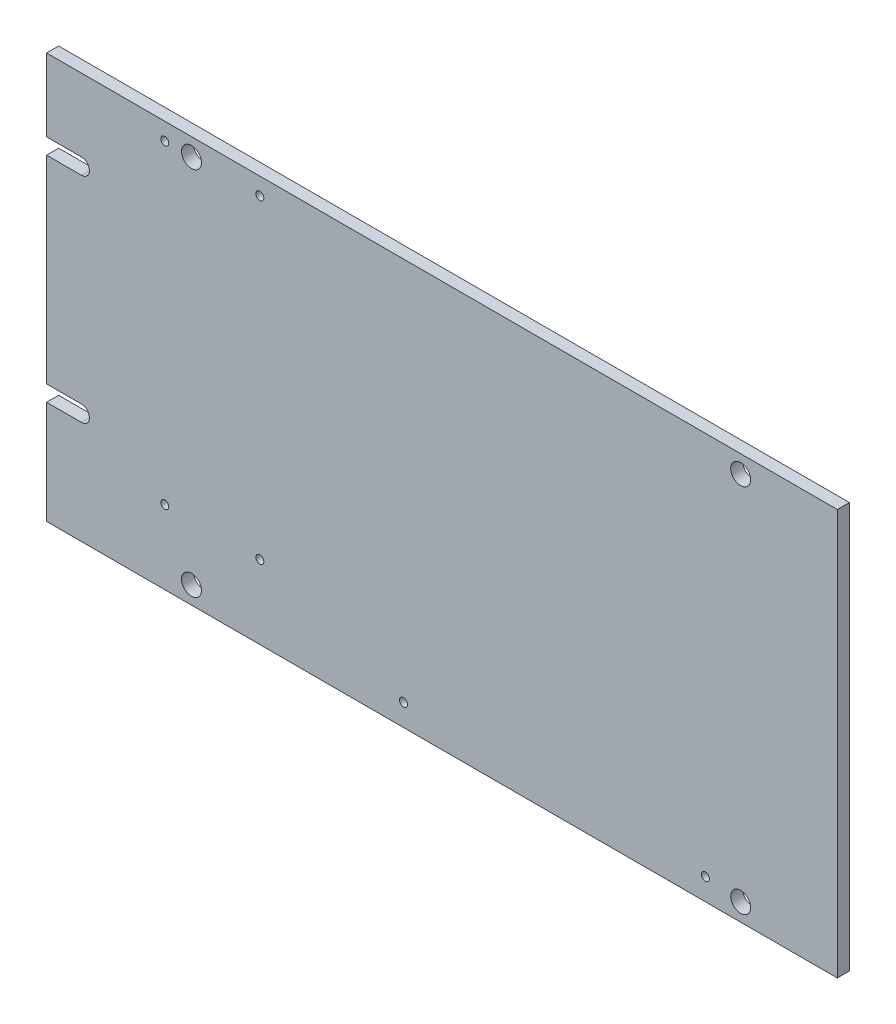
ISO-10303-21;
HEADER;
FILE_DESCRIPTION(('STEP AP214'),'2;1');
FILE_NAME('part.step','',(''),(''),'','','');
FILE_SCHEMA(('AUTOMOTIVE_DESIGN { 1 0 10303 214 1 1 1 1 }'));
ENDSEC;
DATA;
#1=APPLICATION_CONTEXT('core data for automotive mechanical design processes');
#2=APPLICATION_PROTOCOL_DEFINITION('international standard','automotive_design',2000,#1);
#3=PRODUCT_CONTEXT('',#1,'mechanical');
#4=PRODUCT('Part','Part','',(#3));
#5=PRODUCT_RELATED_PRODUCT_CATEGORY('part','',(#4));
#6=PRODUCT_DEFINITION_FORMATION('','',#4);
#7=PRODUCT_DEFINITION_CONTEXT('part definition',#1,'design');
#8=PRODUCT_DEFINITION('design','',#6,#7);
#9=PRODUCT_DEFINITION_SHAPE('','',#8);
#10=(LENGTH_UNIT() NAMED_UNIT(*) SI_UNIT(.MILLI.,.METRE.));
#11=(NAMED_UNIT(*) PLANE_ANGLE_UNIT() SI_UNIT($,.RADIAN.));
#12=(NAMED_UNIT(*) SI_UNIT($,.STERADIAN.) SOLID_ANGLE_UNIT());
#13=UNCERTAINTY_MEASURE_WITH_UNIT(LENGTH_MEASURE(1.E-05),#10,'distance_accuracy_value','');
#14=(GEOMETRIC_REPRESENTATION_CONTEXT(3) GLOBAL_UNCERTAINTY_ASSIGNED_CONTEXT((#13)) GLOBAL_UNIT_ASSIGNED_CONTEXT((#10,
#11,#12)) REPRESENTATION_CONTEXT('',''));
#15=CARTESIAN_POINT('',(0.,0.,0.));
#16=DIRECTION('',(0.,0.,1.));
#17=DIRECTION('',(1.,0.,0.));
#18=AXIS2_PLACEMENT_3D('',#15,#16,#17);
#19=CARTESIAN_POINT('',(0.,15.183,0.));
#20=DIRECTION('',(-1.,0.,0.));
#21=DIRECTION('',(0.,1.,0.));
#22=AXIS2_PLACEMENT_3D('',#19,#20,#21);
#23=PLANE('',#22);
#24=DIRECTION('',(0.,0.,1.));
#25=VECTOR('',#24,1.);
#26=CARTESIAN_POINT('',(0.,15.183,0.));
#27=LINE('',#26,#25);
#28=CARTESIAN_POINT('',(0.,15.183,0.));
#29=VERTEX_POINT('',#28);
#30=CARTESIAN_POINT('',(0.,15.183,1.539748));
#31=VERTEX_POINT('',#30);
#32=EDGE_CURVE('E11',#29,#31,#27,.T.);
#33=ORIENTED_EDGE('',*,*,#32,.T.);
#34=DIRECTION('',(0.,1.,0.));
#35=VECTOR('',#34,1.);
#36=CARTESIAN_POINT('',(0.,15.183,1.539748));
#37=LINE('',#36,#35);
#38=CARTESIAN_POINT('',(0.,40.437,1.539748));
#39=VERTEX_POINT('',#38);
#40=EDGE_CURVE('E43',#31,#39,#37,.T.);
#41=ORIENTED_EDGE('',*,*,#40,.T.);
#42=DIRECTION('',(0.,0.,1.));
#43=VECTOR('',#42,1.);
#44=CARTESIAN_POINT('',(0.,40.437,0.));
#45=LINE('',#44,#43);
#46=CARTESIAN_POINT('',(0.,40.437,0.));
#47=VERTEX_POINT('',#46);
#48=EDGE_CURVE('E303',#47,#39,#45,.T.);
#49=ORIENTED_EDGE('',*,*,#48,.F.);
#50=DIRECTION('',(0.,1.,0.));
#51=VECTOR('',#50,1.);
#52=CARTESIAN_POINT('',(0.,15.183,0.));
#53=LINE('',#52,#51);
#54=EDGE_CURVE('E300',#29,#47,#53,.T.);
#55=ORIENTED_EDGE('',*,*,#54,.F.);
#56=EDGE_LOOP('',(#33,#41,#49,#55));
#57=FACE_BOUND('',#56,.T.);
#58=ADVANCED_FACE('F36',(#57),#23,.T.);
#59=CARTESIAN_POINT('',(0.,40.437,0.));
#60=DIRECTION('',(0.,1.,0.));
#61=DIRECTION('',(1.,0.,0.));
#62=AXIS2_PLACEMENT_3D('',#59,#60,#61);
#63=PLANE('',#62);
#64=ORIENTED_EDGE('',*,*,#48,.T.);
#65=DIRECTION('',(1.,0.,0.));
#66=VECTOR('',#65,1.);
#67=CARTESIAN_POINT('',(0.,40.437,1.539748));
#68=LINE('',#67,#66);
#69=CARTESIAN_POINT('',(4.445,40.437,1.539748));
#70=VERTEX_POINT('',#69);
#71=EDGE_CURVE('E297',#39,#70,#68,.T.);
#72=ORIENTED_EDGE('',*,*,#71,.T.);
#73=DIRECTION('',(0.,0.,1.));
#74=VECTOR('',#73,1.);
#75=CARTESIAN_POINT('',(4.445,40.437,0.));
#76=LINE('',#75,#74);
#77=CARTESIAN_POINT('',(4.445,40.437,0.));
#78=VERTEX_POINT('',#77);
#79=EDGE_CURVE('E295',#78,#70,#76,.T.);
#80=ORIENTED_EDGE('',*,*,#79,.F.);
#81=DIRECTION('',(1.,0.,0.));
#82=VECTOR('',#81,1.);
#83=CARTESIAN_POINT('',(0.,40.437,0.));
#84=LINE('',#83,#82);
#85=EDGE_CURVE('E292',#47,#78,#84,.T.);
#86=ORIENTED_EDGE('',*,*,#85,.F.);
#87=EDGE_LOOP('',(#64,#72,#80,#86));
#88=FACE_BOUND('',#87,.T.);
#89=ADVANCED_FACE('F312',(#88),#63,.T.);
#90=CARTESIAN_POINT('',(4.4455,41.4465,0.));
#91=DIRECTION('',(0.,0.,-1.));
#92=DIRECTION('',(-0.000495294639591737,-0.999999877341602,0.));
#93=AXIS2_PLACEMENT_3D('',#90,#91,#92);
#94=CYLINDRICAL_SURFACE('',#93,1.0095001238237);
#95=ORIENTED_EDGE('',*,*,#79,.T.);
#96=CARTESIAN_POINT('',(4.4455,41.4465,1.539748));
#97=DIRECTION('',(0.,0.,1.));
#98=DIRECTION('',(-0.000495294639591737,-0.999999877341602,0.));
#99=AXIS2_PLACEMENT_3D('',#96,#97,#98);
#100=CIRCLE('',#99,1.0095001238237);
#101=CARTESIAN_POINT('',(4.445,42.456,1.539748));
#102=VERTEX_POINT('',#101);
#103=EDGE_CURVE('E289',#70,#102,#100,.T.);
#104=ORIENTED_EDGE('',*,*,#103,.T.);
#105=DIRECTION('',(0.,0.,1.));
#106=VECTOR('',#105,1.);
#107=CARTESIAN_POINT('',(4.445,42.456,0.));
#108=LINE('',#107,#106);
#109=CARTESIAN_POINT('',(4.445,42.456,0.));
#110=VERTEX_POINT('',#109);
#111=EDGE_CURVE('E287',#110,#102,#108,.T.);
#112=ORIENTED_EDGE('',*,*,#111,.F.);
#113=CARTESIAN_POINT('',(4.4455,41.4465,0.));
#114=DIRECTION('',(0.,0.,1.));
#115=DIRECTION('',(-0.000495294639591737,-0.999999877341602,0.));
#116=AXIS2_PLACEMENT_3D('',#113,#114,#115);
#117=CIRCLE('',#116,1.0095001238237);
#118=EDGE_CURVE('E284',#78,#110,#117,.T.);
#119=ORIENTED_EDGE('',*,*,#118,.F.);
#120=EDGE_LOOP('',(#95,#104,#112,#119));
#121=FACE_BOUND('',#120,.T.);
#122=ADVANCED_FACE('F319',(#121),#94,.F.);
#123=CARTESIAN_POINT('',(4.445,42.456,0.));
#124=DIRECTION('',(0.,-1.,0.));
#125=DIRECTION('',(-1.,0.,0.));
#126=AXIS2_PLACEMENT_3D('',#123,#124,#125);
#127=PLANE('',#126);
#128=ORIENTED_EDGE('',*,*,#111,.T.);
#129=DIRECTION('',(-1.,0.,0.));
#130=VECTOR('',#129,1.);
#131=CARTESIAN_POINT('',(4.445,42.456,1.539748));
#132=LINE('',#131,#130);
#133=CARTESIAN_POINT('',(0.,42.456,1.539748));
#134=VERTEX_POINT('',#133);
#135=EDGE_CURVE('E281',#102,#134,#132,.T.);
#136=ORIENTED_EDGE('',*,*,#135,.T.);
#137=DIRECTION('',(0.,0.,1.));
#138=VECTOR('',#137,1.);
#139=CARTESIAN_POINT('',(0.,42.456,0.));
#140=LINE('',#139,#138);
#141=CARTESIAN_POINT('',(0.,42.456,0.));
#142=VERTEX_POINT('',#141);
#143=EDGE_CURVE('E279',#142,#134,#140,.T.);
#144=ORIENTED_EDGE('',*,*,#143,.F.);
#145=DIRECTION('',(-1.,0.,0.));
#146=VECTOR('',#145,1.);
#147=CARTESIAN_POINT('',(4.445,42.456,0.));
#148=LINE('',#147,#146);
#149=EDGE_CURVE('E276',#110,#142,#148,.T.);
#150=ORIENTED_EDGE('',*,*,#149,.F.);
#151=EDGE_LOOP('',(#128,#136,#144,#150));
#152=FACE_BOUND('',#151,.T.);
#153=ADVANCED_FACE('F321',(#152),#127,.T.);
#154=CARTESIAN_POINT('',(0.,42.456,0.));
#155=DIRECTION('',(-1.,0.,0.));
#156=DIRECTION('',(0.,1.,0.));
#157=AXIS2_PLACEMENT_3D('',#154,#155,#156);
#158=PLANE('',#157);
#159=ORIENTED_EDGE('',*,*,#143,.T.);
#160=DIRECTION('',(0.,1.,0.));
#161=VECTOR('',#160,1.);
#162=CARTESIAN_POINT('',(0.,42.456,1.539748));
#163=LINE('',#162,#161);
#164=CARTESIAN_POINT('',(0.,51.714,1.539748));
#165=VERTEX_POINT('',#164);
#166=EDGE_CURVE('E273',#134,#165,#163,.T.);
#167=ORIENTED_EDGE('',*,*,#166,.T.);
#168=DIRECTION('',(0.,0.,1.));
#169=VECTOR('',#168,1.);
#170=CARTESIAN_POINT('',(0.,51.714,0.));
#171=LINE('',#170,#169);
#172=CARTESIAN_POINT('',(0.,51.714,0.));
#173=VERTEX_POINT('',#172);
#174=EDGE_CURVE('E271',#173,#165,#171,.T.);
#175=ORIENTED_EDGE('',*,*,#174,.F.);
#176=DIRECTION('',(0.,1.,0.));
#177=VECTOR('',#176,1.);
#178=CARTESIAN_POINT('',(0.,42.456,0.));
#179=LINE('',#178,#177);
#180=EDGE_CURVE('E268',#142,#173,#179,.T.);
#181=ORIENTED_EDGE('',*,*,#180,.F.);
#182=EDGE_LOOP('',(#159,#167,#175,#181));
#183=FACE_BOUND('',#182,.T.);
#184=ADVANCED_FACE('F326',(#183),#158,.T.);
#185=CARTESIAN_POINT('',(0.,51.714,0.));
#186=DIRECTION('',(0.,1.,0.));
#187=DIRECTION('',(1.,0.,0.));
#188=AXIS2_PLACEMENT_3D('',#185,#186,#187);
#189=PLANE('',#188);
#190=ORIENTED_EDGE('',*,*,#174,.T.);
#191=DIRECTION('',(1.,0.,0.));
#192=VECTOR('',#191,1.);
#193=CARTESIAN_POINT('',(0.,51.714,1.539748));
#194=LINE('',#193,#192);
#195=CARTESIAN_POINT('',(100.787,51.714,1.539748));
#196=VERTEX_POINT('',#195);
#197=EDGE_CURVE('E265',#165,#196,#194,.T.);
#198=ORIENTED_EDGE('',*,*,#197,.T.);
#199=DIRECTION('',(0.,0.,1.));
#200=VECTOR('',#199,1.);
#201=CARTESIAN_POINT('',(100.787,51.714,0.));
#202=LINE('',#201,#200);
#203=CARTESIAN_POINT('',(100.787,51.714,0.));
#204=VERTEX_POINT('',#203);
#205=EDGE_CURVE('E263',#204,#196,#202,.T.);
#206=ORIENTED_EDGE('',*,*,#205,.F.);
#207=DIRECTION('',(1.,0.,0.));
#208=VECTOR('',#207,1.);
#209=CARTESIAN_POINT('',(0.,51.714,0.));
#210=LINE('',#209,#208);
#211=EDGE_CURVE('E260',#173,#204,#210,.T.);
#212=ORIENTED_EDGE('',*,*,#211,.F.);
#213=EDGE_LOOP('',(#190,#198,#206,#212));
#214=FACE_BOUND('',#213,.T.);
#215=ADVANCED_FACE('F329',(#214),#189,.T.);
#216=CARTESIAN_POINT('',(100.787,51.714,0.));
#217=DIRECTION('',(1.,0.,0.));
#218=DIRECTION('',(0.,-1.,0.));
#219=AXIS2_PLACEMENT_3D('',#216,#217,#218);
#220=PLANE('',#219);
#221=ORIENTED_EDGE('',*,*,#205,.T.);
#222=DIRECTION('',(0.,-1.,0.));
#223=VECTOR('',#222,1.);
#224=CARTESIAN_POINT('',(100.787,51.714,1.539748));
#225=LINE('',#224,#223);
#226=CARTESIAN_POINT('',(100.787,0.,1.539748));
#227=VERTEX_POINT('',#226);
#228=EDGE_CURVE('E257',#196,#227,#225,.T.);
#229=ORIENTED_EDGE('',*,*,#228,.T.);
#230=DIRECTION('',(0.,0.,1.));
#231=VECTOR('',#230,1.);
#232=CARTESIAN_POINT('',(100.787,0.,0.));
#233=LINE('',#232,#231);
#234=CARTESIAN_POINT('',(100.787,0.,0.));
#235=VERTEX_POINT('',#234);
#236=EDGE_CURVE('E255',#235,#227,#233,.T.);
#237=ORIENTED_EDGE('',*,*,#236,.F.);
#238=DIRECTION('',(0.,-1.,0.));
#239=VECTOR('',#238,1.);
#240=CARTESIAN_POINT('',(100.787,51.714,0.));
#241=LINE('',#240,#239);
#242=EDGE_CURVE('E252',#204,#235,#241,.T.);
#243=ORIENTED_EDGE('',*,*,#242,.F.);
#244=EDGE_LOOP('',(#221,#229,#237,#243));
#245=FACE_BOUND('',#244,.T.);
#246=ADVANCED_FACE('F334',(#245),#220,.T.);
#247=CARTESIAN_POINT('',(100.787,0.,0.));
#248=DIRECTION('',(0.,-1.,0.));
#249=DIRECTION('',(-1.,0.,0.));
#250=AXIS2_PLACEMENT_3D('',#247,#248,#249);
#251=PLANE('',#250);
#252=ORIENTED_EDGE('',*,*,#236,.T.);
#253=DIRECTION('',(-1.,0.,0.));
#254=VECTOR('',#253,1.);
#255=CARTESIAN_POINT('',(100.787,0.,1.539748));
#256=LINE('',#255,#254);
#257=CARTESIAN_POINT('',(0.,0.,1.539748));
#258=VERTEX_POINT('',#257);
#259=EDGE_CURVE('E249',#227,#258,#256,.T.);
#260=ORIENTED_EDGE('',*,*,#259,.T.);
#261=DIRECTION('',(0.,0.,1.));
#262=VECTOR('',#261,1.);
#263=CARTESIAN_POINT('',(0.,0.,0.));
#264=LINE('',#263,#262);
#265=CARTESIAN_POINT('',(0.,0.,0.));
#266=VERTEX_POINT('',#265);
#267=EDGE_CURVE('E247',#266,#258,#264,.T.);
#268=ORIENTED_EDGE('',*,*,#267,.F.);
#269=DIRECTION('',(-1.,0.,0.));
#270=VECTOR('',#269,1.);
#271=CARTESIAN_POINT('',(100.787,0.,0.));
#272=LINE('',#271,#270);
#273=EDGE_CURVE('E244',#235,#266,#272,.T.);
#274=ORIENTED_EDGE('',*,*,#273,.F.);
#275=EDGE_LOOP('',(#252,#260,#268,#274));
#276=FACE_BOUND('',#275,.T.);
#277=ADVANCED_FACE('F337',(#276),#251,.T.);
#278=CARTESIAN_POINT('',(0.,0.,0.));
#279=DIRECTION('',(-1.,0.,0.));
#280=DIRECTION('',(0.,1.,0.));
#281=AXIS2_PLACEMENT_3D('',#278,#279,#280);
#282=PLANE('',#281);
#283=ORIENTED_EDGE('',*,*,#267,.T.);
#284=DIRECTION('',(0.,1.,0.));
#285=VECTOR('',#284,1.);
#286=CARTESIAN_POINT('',(0.,0.,1.539748));
#287=LINE('',#286,#285);
#288=CARTESIAN_POINT('',(0.,13.157,1.539748));
#289=VERTEX_POINT('',#288);
#290=EDGE_CURVE('E241',#258,#289,#287,.T.);
#291=ORIENTED_EDGE('',*,*,#290,.T.);
#292=DIRECTION('',(0.,0.,1.));
#293=VECTOR('',#292,1.);
#294=CARTESIAN_POINT('',(0.,13.157,0.));
#295=LINE('',#294,#293);
#296=CARTESIAN_POINT('',(0.,13.157,0.));
#297=VERTEX_POINT('',#296);
#298=EDGE_CURVE('E239',#297,#289,#295,.T.);
#299=ORIENTED_EDGE('',*,*,#298,.F.);
#300=DIRECTION('',(0.,1.,0.));
#301=VECTOR('',#300,1.);
#302=CARTESIAN_POINT('',(0.,0.,0.));
#303=LINE('',#302,#301);
#304=EDGE_CURVE('E236',#266,#297,#303,.T.);
#305=ORIENTED_EDGE('',*,*,#304,.F.);
#306=EDGE_LOOP('',(#283,#291,#299,#305));
#307=FACE_BOUND('',#306,.T.);
#308=ADVANCED_FACE('F342',(#307),#282,.T.);
#309=CARTESIAN_POINT('',(0.,13.157,0.));
#310=DIRECTION('',(0.,1.,0.));
#311=DIRECTION('',(1.,0.,0.));
#312=AXIS2_PLACEMENT_3D('',#309,#310,#311);
#313=PLANE('',#312);
#314=ORIENTED_EDGE('',*,*,#298,.T.);
#315=DIRECTION('',(1.,0.,0.));
#316=VECTOR('',#315,1.);
#317=CARTESIAN_POINT('',(0.,13.157,1.539748));
#318=LINE('',#317,#316);
#319=CARTESIAN_POINT('',(4.445,13.157,1.539748));
#320=VERTEX_POINT('',#319);
#321=EDGE_CURVE('E233',#289,#320,#318,.T.);
#322=ORIENTED_EDGE('',*,*,#321,.T.);
#323=DIRECTION('',(0.,0.,1.));
#324=VECTOR('',#323,1.);
#325=CARTESIAN_POINT('',(4.445,13.157,0.));
#326=LINE('',#325,#324);
#327=CARTESIAN_POINT('',(4.445,13.157,0.));
#328=VERTEX_POINT('',#327);
#329=EDGE_CURVE('E231',#328,#320,#326,.T.);
#330=ORIENTED_EDGE('',*,*,#329,.F.);
#331=DIRECTION('',(1.,0.,0.));
#332=VECTOR('',#331,1.);
#333=CARTESIAN_POINT('',(0.,13.157,0.));
#334=LINE('',#333,#332);
#335=EDGE_CURVE('E228',#297,#328,#334,.T.);
#336=ORIENTED_EDGE('',*,*,#335,.F.);
#337=EDGE_LOOP('',(#314,#322,#330,#336));
#338=FACE_BOUND('',#337,.T.);
#339=ADVANCED_FACE('F345',(#338),#313,.T.);
#340=CARTESIAN_POINT('',(4.445,14.173,0.));
#341=DIRECTION('',(0.,0.,-1.));
#342=DIRECTION('',(0.,-1.,0.));
#343=AXIS2_PLACEMENT_3D('',#340,#341,#342);
#344=CYLINDRICAL_SURFACE('',#343,1.016);
#345=ORIENTED_EDGE('',*,*,#329,.T.);
#346=CARTESIAN_POINT('',(4.445,14.173,1.539748));
#347=DIRECTION('',(0.,0.,1.));
#348=DIRECTION('',(0.,-1.,0.));
#349=AXIS2_PLACEMENT_3D('',#346,#347,#348);
#350=CIRCLE('',#349,1.016);
#351=CARTESIAN_POINT('',(4.445,15.189,1.539748));
#352=VERTEX_POINT('',#351);
#353=EDGE_CURVE('E225',#320,#352,#350,.T.);
#354=ORIENTED_EDGE('',*,*,#353,.T.);
#355=DIRECTION('',(0.,0.,1.));
#356=VECTOR('',#355,1.);
#357=CARTESIAN_POINT('',(4.445,15.189,0.));
#358=LINE('',#357,#356);
#359=CARTESIAN_POINT('',(4.445,15.189,0.));
#360=VERTEX_POINT('',#359);
#361=EDGE_CURVE('E223',#360,#352,#358,.T.);
#362=ORIENTED_EDGE('',*,*,#361,.F.);
#363=CARTESIAN_POINT('',(4.445,14.173,0.));
#364=DIRECTION('',(0.,0.,1.));
#365=DIRECTION('',(0.,-1.,0.));
#366=AXIS2_PLACEMENT_3D('',#363,#364,#365);
#367=CIRCLE('',#366,1.016);
#368=EDGE_CURVE('E220',#328,#360,#367,.T.);
#369=ORIENTED_EDGE('',*,*,#368,.F.);
#370=EDGE_LOOP('',(#345,#354,#362,#369));
#371=FACE_BOUND('',#370,.T.);
#372=ADVANCED_FACE('F349',(#371),#344,.F.);
#373=CARTESIAN_POINT('',(4.445,15.189,0.));
#374=DIRECTION('',(0.0013498300413666,-0.999999088979015,0.));
#375=DIRECTION('',(-0.999999088979015,-0.0013498300413666,0.));
#376=AXIS2_PLACEMENT_3D('',#373,#374,#375);
#377=PLANE('',#376);
#378=ORIENTED_EDGE('',*,*,#361,.T.);
#379=DIRECTION('',(-0.999999088979015,-0.0013498300413666,0.));
#380=VECTOR('',#379,1.);
#381=CARTESIAN_POINT('',(4.445,15.189,1.539748));
#382=LINE('',#381,#380);
#383=EDGE_CURVE('E218',#352,#31,#382,.T.);
#384=ORIENTED_EDGE('',*,*,#383,.T.);
#385=ORIENTED_EDGE('',*,*,#32,.F.);
#386=DIRECTION('',(-0.999999088979015,-0.0013498300413666,0.));
#387=VECTOR('',#386,1.);
#388=CARTESIAN_POINT('',(4.445,15.189,0.));
#389=LINE('',#388,#387);
#390=EDGE_CURVE('E215',#360,#29,#389,.T.);
#391=ORIENTED_EDGE('',*,*,#390,.F.);
#392=EDGE_LOOP('',(#378,#384,#385,#391));
#393=FACE_BOUND('',#392,.T.);
#394=ADVANCED_FACE('F350',(#393),#377,.T.);
#395=CARTESIAN_POINT('',(15.062,9.4,0.));
#396=DIRECTION('',(0.,0.,-1.));
#397=DIRECTION('',(1.,0.,0.));
#398=AXIS2_PLACEMENT_3D('',#395,#396,#397);
#399=CYLINDRICAL_SURFACE('',#398,0.51);
#400=DIRECTION('',(0.,0.,1.));
#401=VECTOR('',#400,1.);
#402=CARTESIAN_POINT('',(15.572,9.4,0.));
#403=LINE('',#402,#401);
#404=CARTESIAN_POINT('',(15.572,9.4,0.));
#405=VERTEX_POINT('',#404);
#406=CARTESIAN_POINT('',(15.572,9.4,1.539748));
#407=VERTEX_POINT('',#406);
#408=EDGE_CURVE('E213',#405,#407,#403,.T.);
#409=ORIENTED_EDGE('',*,*,#408,.T.);
#410=CARTESIAN_POINT('',(15.062,9.4,1.539748));
#411=DIRECTION('',(0.,0.,1.));
#412=DIRECTION('',(1.,0.,0.));
#413=AXIS2_PLACEMENT_3D('',#410,#411,#412);
#414=CIRCLE('',#413,0.51);
#415=EDGE_CURVE('E210',#407,#407,#414,.T.);
#416=ORIENTED_EDGE('',*,*,#415,.T.);
#417=ORIENTED_EDGE('',*,*,#408,.F.);
#418=CARTESIAN_POINT('',(15.062,9.4,0.));
#419=DIRECTION('',(0.,0.,1.));
#420=DIRECTION('',(1.,0.,0.));
#421=AXIS2_PLACEMENT_3D('',#418,#419,#420);
#422=CIRCLE('',#421,0.51);
#423=EDGE_CURVE('E207',#405,#405,#422,.T.);
#424=ORIENTED_EDGE('',*,*,#423,.F.);
#425=EDGE_LOOP('',(#409,#416,#417,#424));
#426=FACE_BOUND('',#425,.T.);
#427=ADVANCED_FACE('F352',(#426),#399,.F.);
#428=CARTESIAN_POINT('',(15.062,49.53,0.));
#429=DIRECTION('',(0.,0.,-1.));
#430=DIRECTION('',(1.,0.,0.));
#431=AXIS2_PLACEMENT_3D('',#428,#429,#430);
#432=CYLINDRICAL_SURFACE('',#431,0.51);
#433=DIRECTION('',(0.,0.,1.));
#434=VECTOR('',#433,1.);
#435=CARTESIAN_POINT('',(15.572,49.53,0.));
#436=LINE('',#435,#434);
#437=CARTESIAN_POINT('',(15.572,49.53,0.));
#438=VERTEX_POINT('',#437);
#439=CARTESIAN_POINT('',(15.572,49.53,1.539748));
#440=VERTEX_POINT('',#439);
#441=EDGE_CURVE('E205',#438,#440,#436,.T.);
#442=ORIENTED_EDGE('',*,*,#441,.T.);
#443=CARTESIAN_POINT('',(15.062,49.53,1.539748));
#444=DIRECTION('',(0.,0.,1.));
#445=DIRECTION('',(1.,0.,0.));
#446=AXIS2_PLACEMENT_3D('',#443,#444,#445);
#447=CIRCLE('',#446,0.51);
#448=EDGE_CURVE('E202',#440,#440,#447,.T.);
#449=ORIENTED_EDGE('',*,*,#448,.T.);
#450=ORIENTED_EDGE('',*,*,#441,.F.);
#451=CARTESIAN_POINT('',(15.062,49.53,0.));
#452=DIRECTION('',(0.,0.,1.));
#453=DIRECTION('',(1.,0.,0.));
#454=AXIS2_PLACEMENT_3D('',#451,#452,#453);
#455=CIRCLE('',#454,0.51);
#456=EDGE_CURVE('E199',#438,#438,#455,.T.);
#457=ORIENTED_EDGE('',*,*,#456,.F.);
#458=EDGE_LOOP('',(#442,#449,#450,#457));
#459=FACE_BOUND('',#458,.T.);
#460=ADVANCED_FACE('F358',(#459),#432,.F.);
#461=CARTESIAN_POINT('',(27.178,49.528,0.));
#462=DIRECTION('',(0.,0.,-1.));
#463=DIRECTION('',(1.,0.,0.));
#464=AXIS2_PLACEMENT_3D('',#461,#462,#463);
#465=CYLINDRICAL_SURFACE('',#464,0.51);
#466=DIRECTION('',(0.,0.,1.));
#467=VECTOR('',#466,1.);
#468=CARTESIAN_POINT('',(27.688,49.528,0.));
#469=LINE('',#468,#467);
#470=CARTESIAN_POINT('',(27.688,49.528,0.));
#471=VERTEX_POINT('',#470);
#472=CARTESIAN_POINT('',(27.688,49.528,1.539748));
#473=VERTEX_POINT('',#472);
#474=EDGE_CURVE('E197',#471,#473,#469,.T.);
#475=ORIENTED_EDGE('',*,*,#474,.T.);
#476=CARTESIAN_POINT('',(27.178,49.528,1.539748));
#477=DIRECTION('',(0.,0.,1.));
#478=DIRECTION('',(1.,0.,0.));
#479=AXIS2_PLACEMENT_3D('',#476,#477,#478);
#480=CIRCLE('',#479,0.51);
#481=EDGE_CURVE('E194',#473,#473,#480,.T.);
#482=ORIENTED_EDGE('',*,*,#481,.T.);
#483=ORIENTED_EDGE('',*,*,#474,.F.);
#484=CARTESIAN_POINT('',(27.178,49.528,0.));
#485=DIRECTION('',(0.,0.,1.));
#486=DIRECTION('',(1.,0.,0.));
#487=AXIS2_PLACEMENT_3D('',#484,#485,#486);
#488=CIRCLE('',#487,0.51);
#489=EDGE_CURVE('E191',#471,#471,#488,.T.);
#490=ORIENTED_EDGE('',*,*,#489,.F.);
#491=EDGE_LOOP('',(#475,#482,#483,#490));
#492=FACE_BOUND('',#491,.T.);
#493=ADVANCED_FACE('F455',(#492),#465,.F.);
#494=CARTESIAN_POINT('',(83.965,2.781,0.));
#495=DIRECTION('',(0.,0.,-1.));
#496=DIRECTION('',(1.,0.,0.));
#497=AXIS2_PLACEMENT_3D('',#494,#495,#496);
#498=CYLINDRICAL_SURFACE('',#497,0.51);
#499=DIRECTION('',(0.,0.,1.));
#500=VECTOR('',#499,1.);
#501=CARTESIAN_POINT('',(84.475,2.781,0.));
#502=LINE('',#501,#500);
#503=CARTESIAN_POINT('',(84.475,2.781,0.));
#504=VERTEX_POINT('',#503);
#505=CARTESIAN_POINT('',(84.475,2.781,1.539748));
#506=VERTEX_POINT('',#505);
#507=EDGE_CURVE('E189',#504,#506,#502,.T.);
#508=ORIENTED_EDGE('',*,*,#507,.T.);
#509=CARTESIAN_POINT('',(83.965,2.781,1.539748));
#510=DIRECTION('',(0.,0.,1.));
#511=DIRECTION('',(1.,0.,0.));
#512=AXIS2_PLACEMENT_3D('',#509,#510,#511);
#513=CIRCLE('',#512,0.51);
#514=EDGE_CURVE('E186',#506,#506,#513,.T.);
#515=ORIENTED_EDGE('',*,*,#514,.T.);
#516=ORIENTED_EDGE('',*,*,#507,.F.);
#517=CARTESIAN_POINT('',(83.965,2.781,0.));
#518=DIRECTION('',(0.,0.,1.));
#519=DIRECTION('',(1.,0.,0.));
#520=AXIS2_PLACEMENT_3D('',#517,#518,#519);
#521=CIRCLE('',#520,0.51);
#522=EDGE_CURVE('E183',#504,#504,#521,.T.);
#523=ORIENTED_EDGE('',*,*,#522,.F.);
#524=EDGE_LOOP('',(#508,#515,#516,#523));
#525=FACE_BOUND('',#524,.T.);
#526=ADVANCED_FACE('F464',(#525),#498,.F.);
#527=CARTESIAN_POINT('',(27.178,9.398,0.));
#528=DIRECTION('',(0.,0.,-1.));
#529=DIRECTION('',(1.,0.,0.));
#530=AXIS2_PLACEMENT_3D('',#527,#528,#529);
#531=CYLINDRICAL_SURFACE('',#530,0.51);
#532=DIRECTION('',(0.,0.,1.));
#533=VECTOR('',#532,1.);
#534=CARTESIAN_POINT('',(27.688,9.398,0.));
#535=LINE('',#534,#533);
#536=CARTESIAN_POINT('',(27.688,9.398,0.));
#537=VERTEX_POINT('',#536);
#538=CARTESIAN_POINT('',(27.688,9.398,1.539748));
#539=VERTEX_POINT('',#538);
#540=EDGE_CURVE('E181',#537,#539,#535,.T.);
#541=ORIENTED_EDGE('',*,*,#540,.T.);
#542=CARTESIAN_POINT('',(27.178,9.398,1.539748));
#543=DIRECTION('',(0.,0.,1.));
#544=DIRECTION('',(1.,0.,0.));
#545=AXIS2_PLACEMENT_3D('',#542,#543,#544);
#546=CIRCLE('',#545,0.51);
#547=EDGE_CURVE('E178',#539,#539,#546,.T.);
#548=ORIENTED_EDGE('',*,*,#547,.T.);
#549=ORIENTED_EDGE('',*,*,#540,.F.);
#550=CARTESIAN_POINT('',(27.178,9.398,0.));
#551=DIRECTION('',(0.,0.,1.));
#552=DIRECTION('',(1.,0.,0.));
#553=AXIS2_PLACEMENT_3D('',#550,#551,#552);
#554=CIRCLE('',#553,0.51);
#555=EDGE_CURVE('E164',#537,#537,#554,.T.);
#556=ORIENTED_EDGE('',*,*,#555,.F.);
#557=EDGE_LOOP('',(#541,#548,#549,#556));
#558=FACE_BOUND('',#557,.T.);
#559=ADVANCED_FACE('F473',(#558),#531,.F.);
#560=CARTESIAN_POINT('',(45.485,2.781,0.));
#561=DIRECTION('',(0.,0.,-1.));
#562=DIRECTION('',(1.,0.,0.));
#563=AXIS2_PLACEMENT_3D('',#560,#561,#562);
#564=CYLINDRICAL_SURFACE('',#563,0.51);
#565=DIRECTION('',(0.,0.,1.));
#566=VECTOR('',#565,1.);
#567=CARTESIAN_POINT('',(45.995,2.781,0.));
#568=LINE('',#567,#566);
#569=CARTESIAN_POINT('',(45.995,2.781,0.));
#570=VERTEX_POINT('',#569);
#571=CARTESIAN_POINT('',(45.995,2.781,1.539748));
#572=VERTEX_POINT('',#571);
#573=EDGE_CURVE('E158',#570,#572,#568,.T.);
#574=ORIENTED_EDGE('',*,*,#573,.T.);
#575=CARTESIAN_POINT('',(45.485,2.781,1.539748));
#576=DIRECTION('',(0.,0.,1.));
#577=DIRECTION('',(1.,0.,0.));
#578=AXIS2_PLACEMENT_3D('',#575,#576,#577);
#579=CIRCLE('',#578,0.51);
#580=EDGE_CURVE('E163',#572,#572,#579,.T.);
#581=ORIENTED_EDGE('',*,*,#580,.T.);
#582=ORIENTED_EDGE('',*,*,#573,.F.);
#583=CARTESIAN_POINT('',(45.485,2.781,0.));
#584=DIRECTION('',(0.,0.,1.));
#585=DIRECTION('',(1.,0.,0.));
#586=AXIS2_PLACEMENT_3D('',#583,#584,#585);
#587=CIRCLE('',#586,0.51);
#588=EDGE_CURVE('E161',#570,#570,#587,.T.);
#589=ORIENTED_EDGE('',*,*,#588,.F.);
#590=EDGE_LOOP('',(#574,#581,#582,#589));
#591=FACE_BOUND('',#590,.T.);
#592=ADVANCED_FACE('F160',(#591),#564,.F.);
#593=CARTESIAN_POINT('',(47.5354664965949,25.9755989802143,0.));
#594=DIRECTION('',(0.,0.,-1.));
#595=DIRECTION('',(-1.,0.,0.));
#596=AXIS2_PLACEMENT_3D('',#593,#594,#595);
#597=PLANE('',#596);
#598=CARTESIAN_POINT('',(18.4656,2.2404832,0.));
#599=DIRECTION('',(0.,0.,-1.));
#600=DIRECTION('',(-1.,0.,0.));
#601=AXIS2_PLACEMENT_3D('',#598,#599,#600);
#602=CIRCLE('',#601,1.27);
#603=CARTESIAN_POINT('',(17.1956,2.2404832,0.));
#604=VERTEX_POINT('',#603);
#605=EDGE_CURVE('E564',#604,#604,#602,.F.);
#606=ORIENTED_EDGE('',*,*,#605,.T.);
#607=EDGE_LOOP('',(#606));
#608=FACE_BOUND('',#607,.T.);
#609=CARTESIAN_POINT('',(88.468,2.2404832,0.));
#610=DIRECTION('',(0.,0.,-1.));
#611=DIRECTION('',(-1.,0.,0.));
#612=AXIS2_PLACEMENT_3D('',#609,#610,#611);
#613=CIRCLE('',#612,1.26999999999999);
#614=CARTESIAN_POINT('',(87.198,2.2404832,0.));
#615=VERTEX_POINT('',#614);
#616=EDGE_CURVE('E566',#615,#615,#613,.F.);
#617=ORIENTED_EDGE('',*,*,#616,.T.);
#618=EDGE_LOOP('',(#617));
#619=FACE_BOUND('',#618,.T.);
#620=CARTESIAN_POINT('',(88.468,49.4590832,0.));
#621=DIRECTION('',(0.,0.,-1.));
#622=DIRECTION('',(-1.,0.,0.));
#623=AXIS2_PLACEMENT_3D('',#620,#621,#622);
#624=CIRCLE('',#623,1.26999999999999);
#625=CARTESIAN_POINT('',(87.198,49.4590832,0.));
#626=VERTEX_POINT('',#625);
#627=EDGE_CURVE('E575',#626,#626,#624,.F.);
#628=ORIENTED_EDGE('',*,*,#627,.T.);
#629=EDGE_LOOP('',(#628));
#630=FACE_BOUND('',#629,.T.);
#631=CARTESIAN_POINT('',(18.4656,49.4590832,0.));
#632=DIRECTION('',(0.,0.,-1.));
#633=DIRECTION('',(-1.,0.,0.));
#634=AXIS2_PLACEMENT_3D('',#631,#632,#633);
#635=CIRCLE('',#634,1.27);
#636=CARTESIAN_POINT('',(17.1956,49.4590832,0.));
#637=VERTEX_POINT('',#636);
#638=EDGE_CURVE('E168',#637,#637,#635,.F.);
#639=ORIENTED_EDGE('',*,*,#638,.T.);
#640=EDGE_LOOP('',(#639));
#641=FACE_BOUND('',#640,.T.);
#642=ORIENTED_EDGE('',*,*,#54,.T.);
#643=ORIENTED_EDGE('',*,*,#85,.T.);
#644=ORIENTED_EDGE('',*,*,#118,.T.);
#645=ORIENTED_EDGE('',*,*,#149,.T.);
#646=ORIENTED_EDGE('',*,*,#180,.T.);
#647=ORIENTED_EDGE('',*,*,#211,.T.);
#648=ORIENTED_EDGE('',*,*,#242,.T.);
#649=ORIENTED_EDGE('',*,*,#273,.T.);
#650=ORIENTED_EDGE('',*,*,#304,.T.);
#651=ORIENTED_EDGE('',*,*,#335,.T.);
#652=ORIENTED_EDGE('',*,*,#368,.T.);
#653=ORIENTED_EDGE('',*,*,#390,.T.);
#654=EDGE_LOOP('',(#642,#643,#644,#645,#646,#647,#648,#649,#650,#651,#652,#653));
#655=FACE_BOUND('',#654,.T.);
#656=ORIENTED_EDGE('',*,*,#423,.T.);
#657=EDGE_LOOP('',(#656));
#658=FACE_BOUND('',#657,.T.);
#659=ORIENTED_EDGE('',*,*,#456,.T.);
#660=EDGE_LOOP('',(#659));
#661=FACE_BOUND('',#660,.T.);
#662=ORIENTED_EDGE('',*,*,#489,.T.);
#663=EDGE_LOOP('',(#662));
#664=FACE_BOUND('',#663,.T.);
#665=ORIENTED_EDGE('',*,*,#522,.T.);
#666=EDGE_LOOP('',(#665));
#667=FACE_BOUND('',#666,.T.);
#668=ORIENTED_EDGE('',*,*,#555,.T.);
#669=EDGE_LOOP('',(#668));
#670=FACE_BOUND('',#669,.T.);
#671=ORIENTED_EDGE('',*,*,#588,.T.);
#672=EDGE_LOOP('',(#671));
#673=FACE_BOUND('',#672,.T.);
#674=ADVANCED_FACE('F167',(#608,#619,#630,#641,#655,#658,#661,#664,#667,#670,#673),#597,.T.);
#675=CARTESIAN_POINT('',(47.5354664965949,25.9755989802143,1.539748));
#676=DIRECTION('',(0.,0.,-1.));
#677=DIRECTION('',(-1.,0.,0.));
#678=AXIS2_PLACEMENT_3D('',#675,#676,#677);
#679=PLANE('',#678);
#680=CARTESIAN_POINT('',(18.4656,2.2404832,1.539748));
#681=DIRECTION('',(0.,0.,1.));
#682=DIRECTION('',(1.,0.,0.));
#683=AXIS2_PLACEMENT_3D('',#680,#681,#682);
#684=CIRCLE('',#683,1.27);
#685=CARTESIAN_POINT('',(19.7356,2.2404832,1.539748));
#686=VERTEX_POINT('',#685);
#687=EDGE_CURVE('E561',#686,#686,#684,.T.);
#688=ORIENTED_EDGE('',*,*,#687,.F.);
#689=EDGE_LOOP('',(#688));
#690=FACE_BOUND('',#689,.T.);
#691=CARTESIAN_POINT('',(88.468,2.2404832,1.539748));
#692=DIRECTION('',(0.,0.,1.));
#693=DIRECTION('',(1.,0.,0.));
#694=AXIS2_PLACEMENT_3D('',#691,#692,#693);
#695=CIRCLE('',#694,1.26999999999999);
#696=CARTESIAN_POINT('',(89.738,2.2404832,1.539748));
#697=VERTEX_POINT('',#696);
#698=EDGE_CURVE('E569',#697,#697,#695,.T.);
#699=ORIENTED_EDGE('',*,*,#698,.F.);
#700=EDGE_LOOP('',(#699));
#701=FACE_BOUND('',#700,.T.);
#702=CARTESIAN_POINT('',(88.468,49.4590832,1.539748));
#703=DIRECTION('',(0.,0.,1.));
#704=DIRECTION('',(1.,0.,0.));
#705=AXIS2_PLACEMENT_3D('',#702,#703,#704);
#706=CIRCLE('',#705,1.26999999999999);
#707=CARTESIAN_POINT('',(89.738,49.4590832,1.539748));
#708=VERTEX_POINT('',#707);
#709=EDGE_CURVE('E572',#708,#708,#706,.T.);
#710=ORIENTED_EDGE('',*,*,#709,.F.);
#711=EDGE_LOOP('',(#710));
#712=FACE_BOUND('',#711,.T.);
#713=CARTESIAN_POINT('',(18.4656,49.4590832,1.539748));
#714=DIRECTION('',(0.,0.,1.));
#715=DIRECTION('',(1.,0.,0.));
#716=AXIS2_PLACEMENT_3D('',#713,#714,#715);
#717=CIRCLE('',#716,1.27);
#718=CARTESIAN_POINT('',(19.7356,49.4590832,1.539748));
#719=VERTEX_POINT('',#718);
#720=EDGE_CURVE('E172',#719,#719,#717,.T.);
#721=ORIENTED_EDGE('',*,*,#720,.F.);
#722=EDGE_LOOP('',(#721));
#723=FACE_BOUND('',#722,.T.);
#724=ORIENTED_EDGE('',*,*,#383,.F.);
#725=ORIENTED_EDGE('',*,*,#353,.F.);
#726=ORIENTED_EDGE('',*,*,#321,.F.);
#727=ORIENTED_EDGE('',*,*,#290,.F.);
#728=ORIENTED_EDGE('',*,*,#259,.F.);
#729=ORIENTED_EDGE('',*,*,#228,.F.);
#730=ORIENTED_EDGE('',*,*,#197,.F.);
#731=ORIENTED_EDGE('',*,*,#166,.F.);
#732=ORIENTED_EDGE('',*,*,#135,.F.);
#733=ORIENTED_EDGE('',*,*,#103,.F.);
#734=ORIENTED_EDGE('',*,*,#71,.F.);
#735=ORIENTED_EDGE('',*,*,#40,.F.);
#736=EDGE_LOOP('',(#724,#725,#726,#727,#728,#729,#730,#731,#732,#733,#734,#735));
#737=FACE_BOUND('',#736,.T.);
#738=ORIENTED_EDGE('',*,*,#415,.F.);
#739=EDGE_LOOP('',(#738));
#740=FACE_BOUND('',#739,.T.);
#741=ORIENTED_EDGE('',*,*,#448,.F.);
#742=EDGE_LOOP('',(#741));
#743=FACE_BOUND('',#742,.T.);
#744=ORIENTED_EDGE('',*,*,#481,.F.);
#745=EDGE_LOOP('',(#744));
#746=FACE_BOUND('',#745,.T.);
#747=ORIENTED_EDGE('',*,*,#514,.F.);
#748=EDGE_LOOP('',(#747));
#749=FACE_BOUND('',#748,.T.);
#750=ORIENTED_EDGE('',*,*,#547,.F.);
#751=EDGE_LOOP('',(#750));
#752=FACE_BOUND('',#751,.T.);
#753=ORIENTED_EDGE('',*,*,#580,.F.);
#754=EDGE_LOOP('',(#753));
#755=FACE_BOUND('',#754,.T.);
#756=ADVANCED_FACE('F308',(#690,#701,#712,#723,#737,#740,#743,#746,#749,#752,#755),#679,.F.);
#757=CARTESIAN_POINT('',(18.4656,49.4590832,-3.59210244842766));
#758=DIRECTION('',(0.,0.,1.));
#759=DIRECTION('',(1.,0.,0.));
#760=AXIS2_PLACEMENT_3D('',#757,#758,#759);
#761=CYLINDRICAL_SURFACE('',#760,1.27);
#762=ORIENTED_EDGE('',*,*,#720,.T.);
#763=EDGE_LOOP('',(#762));
#764=FACE_BOUND('',#763,.T.);
#765=ORIENTED_EDGE('',*,*,#638,.F.);
#766=EDGE_LOOP('',(#765));
#767=FACE_BOUND('',#766,.T.);
#768=ADVANCED_FACE('F506',(#764,#767),#761,.F.);
#769=CARTESIAN_POINT('',(88.468,49.4590832,-3.59210244842766));
#770=DIRECTION('',(0.,0.,1.));
#771=DIRECTION('',(1.,0.,0.));
#772=AXIS2_PLACEMENT_3D('',#769,#770,#771);
#773=CYLINDRICAL_SURFACE('',#772,1.26999999999999);
#774=ORIENTED_EDGE('',*,*,#709,.T.);
#775=EDGE_LOOP('',(#774));
#776=FACE_BOUND('',#775,.T.);
#777=ORIENTED_EDGE('',*,*,#627,.F.);
#778=EDGE_LOOP('',(#777));
#779=FACE_BOUND('',#778,.T.);
#780=ADVANCED_FACE('F516',(#776,#779),#773,.F.);
#781=CARTESIAN_POINT('',(88.468,2.2404832,-3.59210244842766));
#782=DIRECTION('',(0.,0.,1.));
#783=DIRECTION('',(1.,0.,0.));
#784=AXIS2_PLACEMENT_3D('',#781,#782,#783);
#785=CYLINDRICAL_SURFACE('',#784,1.26999999999999);
#786=ORIENTED_EDGE('',*,*,#698,.T.);
#787=EDGE_LOOP('',(#786));
#788=FACE_BOUND('',#787,.T.);
#789=ORIENTED_EDGE('',*,*,#616,.F.);
#790=EDGE_LOOP('',(#789));
#791=FACE_BOUND('',#790,.T.);
#792=ADVANCED_FACE('F527',(#788,#791),#785,.F.);
#793=CARTESIAN_POINT('',(18.4656,2.2404832,-3.59210244842766));
#794=DIRECTION('',(0.,0.,1.));
#795=DIRECTION('',(1.,0.,0.));
#796=AXIS2_PLACEMENT_3D('',#793,#794,#795);
#797=CYLINDRICAL_SURFACE('',#796,1.27);
#798=ORIENTED_EDGE('',*,*,#687,.T.);
#799=EDGE_LOOP('',(#798));
#800=FACE_BOUND('',#799,.T.);
#801=ORIENTED_EDGE('',*,*,#605,.F.);
#802=EDGE_LOOP('',(#801));
#803=FACE_BOUND('',#802,.T.);
#804=ADVANCED_FACE('F538',(#800,#803),#797,.F.);
#805=CLOSED_SHELL('',(#58,#89,#122,#153,#184,#215,#246,#277,#308,#339,#372,#394,#427,#460,#493,
#526,#559,#592,#674,#756,#768,#780,#792,#804));
#806=MANIFOLD_SOLID_BREP('B2',#805);
#807=ADVANCED_BREP_SHAPE_REPRESENTATION('',(#18,#806),#14);
#808=SHAPE_DEFINITION_REPRESENTATION(#9,#807);
ENDSEC;
END-ISO-10303-21;
